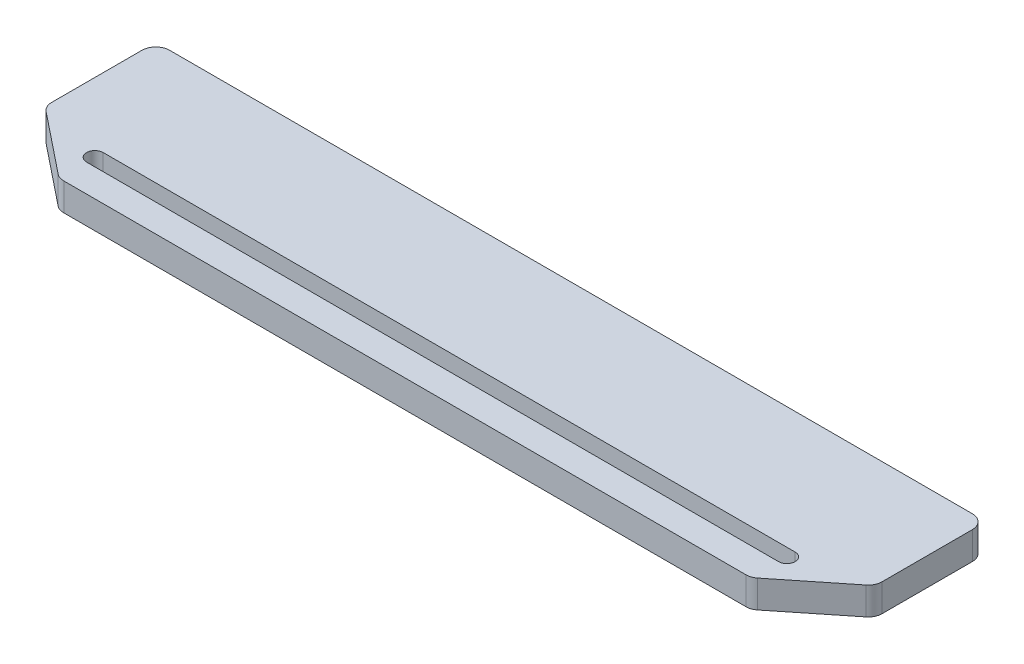
ISO-10303-21;
HEADER;
FILE_DESCRIPTION(('STEP AP214'),'2;1');
FILE_NAME('part.step','',(''),(''),'','','');
FILE_SCHEMA(('AUTOMOTIVE_DESIGN { 1 0 10303 214 1 1 1 1 }'));
ENDSEC;
DATA;
#1=APPLICATION_CONTEXT('core data for automotive mechanical design processes');
#2=APPLICATION_PROTOCOL_DEFINITION('international standard','automotive_design',2000,#1);
#3=PRODUCT_CONTEXT('',#1,'mechanical');
#4=PRODUCT('Part','Part','',(#3));
#5=PRODUCT_RELATED_PRODUCT_CATEGORY('part','',(#4));
#6=PRODUCT_DEFINITION_FORMATION('','',#4);
#7=PRODUCT_DEFINITION_CONTEXT('part definition',#1,'design');
#8=PRODUCT_DEFINITION('design','',#6,#7);
#9=PRODUCT_DEFINITION_SHAPE('','',#8);
#10=(LENGTH_UNIT() NAMED_UNIT(*) SI_UNIT(.MILLI.,.METRE.));
#11=(NAMED_UNIT(*) PLANE_ANGLE_UNIT() SI_UNIT($,.RADIAN.));
#12=(NAMED_UNIT(*) SI_UNIT($,.STERADIAN.) SOLID_ANGLE_UNIT());
#13=UNCERTAINTY_MEASURE_WITH_UNIT(LENGTH_MEASURE(1.E-05),#10,'distance_accuracy_value','');
#14=(GEOMETRIC_REPRESENTATION_CONTEXT(3) GLOBAL_UNCERTAINTY_ASSIGNED_CONTEXT((#13)) GLOBAL_UNIT_ASSIGNED_CONTEXT((#10,
#11,#12)) REPRESENTATION_CONTEXT('',''));
#15=CARTESIAN_POINT('',(0.,0.,0.));
#16=DIRECTION('',(0.,0.,1.));
#17=DIRECTION('',(1.,0.,0.));
#18=AXIS2_PLACEMENT_3D('',#15,#16,#17);
#19=CARTESIAN_POINT('',(295.,10.,5.));
#20=DIRECTION('',(0.,1.,0.));
#21=DIRECTION('',(0.,0.,1.));
#22=AXIS2_PLACEMENT_3D('',#19,#20,#21);
#23=PLANE('',#22);
#24=CARTESIAN_POINT('',(295.,10.,5.));
#25=DIRECTION('',(0.,1.,0.));
#26=DIRECTION('',(0.,0.,1.));
#27=AXIS2_PLACEMENT_3D('',#24,#25,#26);
#28=CIRCLE('',#27,5.);
#29=CARTESIAN_POINT('',(300.,10.,5.00000000000004));
#30=VERTEX_POINT('',#29);
#31=CARTESIAN_POINT('',(295.,10.,0.));
#32=VERTEX_POINT('',#31);
#33=EDGE_CURVE('E174',#30,#32,#28,.T.);
#34=ORIENTED_EDGE('',*,*,#33,.T.);
#35=DIRECTION('',(-1.,0.,0.));
#36=VECTOR('',#35,1.);
#37=CARTESIAN_POINT('',(5.00000000000004,10.,0.));
#38=LINE('',#37,#36);
#39=CARTESIAN_POINT('',(5.,10.,0.));
#40=VERTEX_POINT('',#39);
#41=EDGE_CURVE('E135',#32,#40,#38,.T.);
#42=ORIENTED_EDGE('',*,*,#41,.T.);
#43=CARTESIAN_POINT('',(5.,10.,5.));
#44=DIRECTION('',(0.,1.,0.));
#45=DIRECTION('',(0.,0.,-1.));
#46=AXIS2_PLACEMENT_3D('',#43,#44,#45);
#47=CIRCLE('',#46,5.);
#48=CARTESIAN_POINT('',(0.,10.,5.00000000000004));
#49=VERTEX_POINT('',#48);
#50=EDGE_CURVE('E185',#40,#49,#47,.T.);
#51=ORIENTED_EDGE('',*,*,#50,.T.);
#52=DIRECTION('',(0.,0.,1.));
#53=VECTOR('',#52,1.);
#54=CARTESIAN_POINT('',(0.,10.,5.00000000000004));
#55=LINE('',#54,#53);
#56=CARTESIAN_POINT('',(0.,10.,37.5968757625672));
#57=VERTEX_POINT('',#56);
#58=EDGE_CURVE('E193',#49,#57,#55,.T.);
#59=ORIENTED_EDGE('',*,*,#58,.T.);
#60=CARTESIAN_POINT('',(5.,10.,37.5968757625672));
#61=DIRECTION('',(0.,1.,0.));
#62=DIRECTION('',(0.,0.,-1.));
#63=AXIS2_PLACEMENT_3D('',#60,#61,#62);
#64=CIRCLE('',#63,5.);
#65=CARTESIAN_POINT('',(1.87652476222788,10.,41.5012198097823));
#66=VERTEX_POINT('',#65);
#67=EDGE_CURVE('E195',#57,#66,#64,.T.);
#68=ORIENTED_EDGE('',*,*,#67,.T.);
#69=DIRECTION('',(0.78086880944303,0.,0.624695047554425));
#70=VECTOR('',#69,1.);
#71=CARTESIAN_POINT('',(1.87652476222788,10.,41.5012198097823));
#72=LINE('',#71,#70);
#73=CARTESIAN_POINT('',(23.6304300590189,10.,58.9043440472152));
#74=VERTEX_POINT('',#73);
#75=EDGE_CURVE('E197',#66,#74,#72,.T.);
#76=ORIENTED_EDGE('',*,*,#75,.T.);
#77=CARTESIAN_POINT('',(26.7539052967911,10.,55.));
#78=DIRECTION('',(0.,1.,0.));
#79=DIRECTION('',(0.,0.,1.));
#80=AXIS2_PLACEMENT_3D('',#77,#78,#79);
#81=CIRCLE('',#80,5.);
#82=CARTESIAN_POINT('',(26.7539052967911,10.,60.));
#83=VERTEX_POINT('',#82);
#84=EDGE_CURVE('E199',#74,#83,#81,.T.);
#85=ORIENTED_EDGE('',*,*,#84,.T.);
#86=DIRECTION('',(1.,0.,0.));
#87=VECTOR('',#86,1.);
#88=CARTESIAN_POINT('',(26.7539052967911,10.,60.));
#89=LINE('',#88,#87);
#90=CARTESIAN_POINT('',(273.246094703209,10.,60.));
#91=VERTEX_POINT('',#90);
#92=EDGE_CURVE('E201',#83,#91,#89,.T.);
#93=ORIENTED_EDGE('',*,*,#92,.T.);
#94=CARTESIAN_POINT('',(273.246094703209,10.,55.));
#95=DIRECTION('',(0.,1.,0.));
#96=DIRECTION('',(0.,0.,-1.));
#97=AXIS2_PLACEMENT_3D('',#94,#95,#96);
#98=CIRCLE('',#97,5.);
#99=CARTESIAN_POINT('',(276.369569940981,10.,58.9043440472152));
#100=VERTEX_POINT('',#99);
#101=EDGE_CURVE('E203',#91,#100,#98,.T.);
#102=ORIENTED_EDGE('',*,*,#101,.T.);
#103=DIRECTION('',(0.78086880944303,0.,-0.624695047554424));
#104=VECTOR('',#103,1.);
#105=CARTESIAN_POINT('',(276.369569940981,10.,58.9043440472152));
#106=LINE('',#105,#104);
#107=CARTESIAN_POINT('',(298.123475237772,10.,41.5012198097823));
#108=VERTEX_POINT('',#107);
#109=EDGE_CURVE('E205',#100,#108,#106,.T.);
#110=ORIENTED_EDGE('',*,*,#109,.T.);
#111=CARTESIAN_POINT('',(295.,10.,37.5968757625672));
#112=DIRECTION('',(0.,1.,0.));
#113=DIRECTION('',(0.,0.,-1.));
#114=AXIS2_PLACEMENT_3D('',#111,#112,#113);
#115=CIRCLE('',#114,5.);
#116=CARTESIAN_POINT('',(300.,10.,37.5968757625672));
#117=VERTEX_POINT('',#116);
#118=EDGE_CURVE('E169',#108,#117,#115,.T.);
#119=ORIENTED_EDGE('',*,*,#118,.T.);
#120=DIRECTION('',(0.,0.,-1.));
#121=VECTOR('',#120,1.);
#122=CARTESIAN_POINT('',(300.,10.,5.00000000000004));
#123=LINE('',#122,#121);
#124=EDGE_CURVE('E171',#117,#30,#123,.T.);
#125=ORIENTED_EDGE('',*,*,#124,.T.);
#126=EDGE_LOOP('',(#34,#42,#51,#59,#68,#76,#85,#93,#102,#110,#119,#125));
#127=FACE_BOUND('',#126,.T.);
#128=DIRECTION('',(1.,0.,0.));
#129=VECTOR('',#128,1.);
#130=CARTESIAN_POINT('',(25.,10.,50.));
#131=LINE('',#130,#129);
#132=CARTESIAN_POINT('',(25.,10.,50.));
#133=VERTEX_POINT('',#132);
#134=CARTESIAN_POINT('',(275.,10.,50.));
#135=VERTEX_POINT('',#134);
#136=EDGE_CURVE('E271',#133,#135,#131,.T.);
#137=ORIENTED_EDGE('',*,*,#136,.F.);
#138=CARTESIAN_POINT('',(25.,10.,47.));
#139=DIRECTION('',(0.,1.,0.));
#140=DIRECTION('',(0.,0.,1.));
#141=AXIS2_PLACEMENT_3D('',#138,#139,#140);
#142=CIRCLE('',#141,3.);
#143=CARTESIAN_POINT('',(25.,10.,44.));
#144=VERTEX_POINT('',#143);
#145=EDGE_CURVE('E281',#144,#133,#142,.T.);
#146=ORIENTED_EDGE('',*,*,#145,.F.);
#147=DIRECTION('',(-1.,0.,0.));
#148=VECTOR('',#147,1.);
#149=CARTESIAN_POINT('',(25.,10.,44.));
#150=LINE('',#149,#148);
#151=CARTESIAN_POINT('',(275.,10.,44.));
#152=VERTEX_POINT('',#151);
#153=EDGE_CURVE('E284',#152,#144,#150,.T.);
#154=ORIENTED_EDGE('',*,*,#153,.F.);
#155=CARTESIAN_POINT('',(275.,10.,47.));
#156=DIRECTION('',(0.,1.,0.));
#157=DIRECTION('',(0.,0.,1.));
#158=AXIS2_PLACEMENT_3D('',#155,#156,#157);
#159=CIRCLE('',#158,3.);
#160=EDGE_CURVE('E287',#135,#152,#159,.T.);
#161=ORIENTED_EDGE('',*,*,#160,.F.);
#162=EDGE_LOOP('',(#137,#146,#154,#161));
#163=FACE_BOUND('',#162,.T.);
#164=ADVANCED_FACE('F41',(#127,#163),#23,.T.);
#165=CARTESIAN_POINT('',(295.,0.,5.));
#166=DIRECTION('',(0.,1.,0.));
#167=DIRECTION('',(0.,0.,1.));
#168=AXIS2_PLACEMENT_3D('',#165,#166,#167);
#169=PLANE('',#168);
#170=CARTESIAN_POINT('',(295.,0.,5.));
#171=DIRECTION('',(0.,1.,0.));
#172=DIRECTION('',(0.,0.,1.));
#173=AXIS2_PLACEMENT_3D('',#170,#171,#172);
#174=CIRCLE('',#173,5.);
#175=CARTESIAN_POINT('',(300.,0.,5.00000000000004));
#176=VERTEX_POINT('',#175);
#177=CARTESIAN_POINT('',(295.,0.,0.));
#178=VERTEX_POINT('',#177);
#179=EDGE_CURVE('E208',#176,#178,#174,.T.);
#180=ORIENTED_EDGE('',*,*,#179,.F.);
#181=DIRECTION('',(0.,0.,-1.));
#182=VECTOR('',#181,1.);
#183=CARTESIAN_POINT('',(300.,0.,5.00000000000004));
#184=LINE('',#183,#182);
#185=CARTESIAN_POINT('',(300.,0.,37.5968757625672));
#186=VERTEX_POINT('',#185);
#187=EDGE_CURVE('E127',#186,#176,#184,.T.);
#188=ORIENTED_EDGE('',*,*,#187,.F.);
#189=CARTESIAN_POINT('',(295.,0.,37.5968757625672));
#190=DIRECTION('',(0.,1.,0.));
#191=DIRECTION('',(0.,0.,-1.));
#192=AXIS2_PLACEMENT_3D('',#189,#190,#191);
#193=CIRCLE('',#192,5.);
#194=CARTESIAN_POINT('',(298.123475237772,0.,41.5012198097823));
#195=VERTEX_POINT('',#194);
#196=EDGE_CURVE('E120',#195,#186,#193,.T.);
#197=ORIENTED_EDGE('',*,*,#196,.F.);
#198=DIRECTION('',(0.78086880944303,0.,-0.624695047554424));
#199=VECTOR('',#198,1.);
#200=CARTESIAN_POINT('',(276.369569940981,0.,58.9043440472152));
#201=LINE('',#200,#199);
#202=CARTESIAN_POINT('',(276.369569940981,0.,58.9043440472152));
#203=VERTEX_POINT('',#202);
#204=EDGE_CURVE('E226',#203,#195,#201,.T.);
#205=ORIENTED_EDGE('',*,*,#204,.F.);
#206=CARTESIAN_POINT('',(273.246094703209,0.,55.));
#207=DIRECTION('',(0.,1.,0.));
#208=DIRECTION('',(0.,0.,-1.));
#209=AXIS2_PLACEMENT_3D('',#206,#207,#208);
#210=CIRCLE('',#209,5.);
#211=CARTESIAN_POINT('',(273.246094703209,0.,60.));
#212=VERTEX_POINT('',#211);
#213=EDGE_CURVE('E224',#212,#203,#210,.T.);
#214=ORIENTED_EDGE('',*,*,#213,.F.);
#215=DIRECTION('',(1.,0.,0.));
#216=VECTOR('',#215,1.);
#217=CARTESIAN_POINT('',(26.7539052967911,0.,60.));
#218=LINE('',#217,#216);
#219=CARTESIAN_POINT('',(26.7539052967911,0.,60.));
#220=VERTEX_POINT('',#219);
#221=EDGE_CURVE('E222',#220,#212,#218,.T.);
#222=ORIENTED_EDGE('',*,*,#221,.F.);
#223=CARTESIAN_POINT('',(26.7539052967911,0.,55.));
#224=DIRECTION('',(0.,1.,0.));
#225=DIRECTION('',(0.,0.,1.));
#226=AXIS2_PLACEMENT_3D('',#223,#224,#225);
#227=CIRCLE('',#226,5.);
#228=CARTESIAN_POINT('',(23.6304300590189,0.,58.9043440472152));
#229=VERTEX_POINT('',#228);
#230=EDGE_CURVE('E220',#229,#220,#227,.T.);
#231=ORIENTED_EDGE('',*,*,#230,.F.);
#232=DIRECTION('',(0.78086880944303,0.,0.624695047554425));
#233=VECTOR('',#232,1.);
#234=CARTESIAN_POINT('',(1.87652476222788,0.,41.5012198097823));
#235=LINE('',#234,#233);
#236=CARTESIAN_POINT('',(1.87652476222788,0.,41.5012198097823));
#237=VERTEX_POINT('',#236);
#238=EDGE_CURVE('E218',#237,#229,#235,.T.);
#239=ORIENTED_EDGE('',*,*,#238,.F.);
#240=CARTESIAN_POINT('',(5.,0.,37.5968757625672));
#241=DIRECTION('',(0.,1.,0.));
#242=DIRECTION('',(0.,0.,-1.));
#243=AXIS2_PLACEMENT_3D('',#240,#241,#242);
#244=CIRCLE('',#243,5.);
#245=CARTESIAN_POINT('',(0.,0.,37.5968757625672));
#246=VERTEX_POINT('',#245);
#247=EDGE_CURVE('E216',#246,#237,#244,.T.);
#248=ORIENTED_EDGE('',*,*,#247,.F.);
#249=DIRECTION('',(0.,0.,1.));
#250=VECTOR('',#249,1.);
#251=CARTESIAN_POINT('',(0.,0.,5.00000000000004));
#252=LINE('',#251,#250);
#253=CARTESIAN_POINT('',(0.,0.,5.00000000000004));
#254=VERTEX_POINT('',#253);
#255=EDGE_CURVE('E214',#254,#246,#252,.T.);
#256=ORIENTED_EDGE('',*,*,#255,.F.);
#257=CARTESIAN_POINT('',(5.,0.,5.));
#258=DIRECTION('',(0.,1.,0.));
#259=DIRECTION('',(0.,0.,-1.));
#260=AXIS2_PLACEMENT_3D('',#257,#258,#259);
#261=CIRCLE('',#260,5.);
#262=CARTESIAN_POINT('',(5.,0.,0.));
#263=VERTEX_POINT('',#262);
#264=EDGE_CURVE('E212',#263,#254,#261,.T.);
#265=ORIENTED_EDGE('',*,*,#264,.F.);
#266=DIRECTION('',(-1.,0.,0.));
#267=VECTOR('',#266,1.);
#268=CARTESIAN_POINT('',(5.00000000000004,0.,0.));
#269=LINE('',#268,#267);
#270=EDGE_CURVE('E85',#178,#263,#269,.T.);
#271=ORIENTED_EDGE('',*,*,#270,.F.);
#272=EDGE_LOOP('',(#180,#188,#197,#205,#214,#222,#231,#239,#248,#256,#265,#271));
#273=FACE_BOUND('',#272,.T.);
#274=CARTESIAN_POINT('',(25.,0.,47.));
#275=DIRECTION('',(0.,-1.,0.));
#276=DIRECTION('',(0.,0.,-1.));
#277=AXIS2_PLACEMENT_3D('',#274,#275,#276);
#278=CIRCLE('',#277,3.);
#279=CARTESIAN_POINT('',(25.,0.,50.));
#280=VERTEX_POINT('',#279);
#281=CARTESIAN_POINT('',(25.,0.,44.));
#282=VERTEX_POINT('',#281);
#283=EDGE_CURVE('E11',#280,#282,#278,.T.);
#284=ORIENTED_EDGE('',*,*,#283,.F.);
#285=DIRECTION('',(-1.,0.,0.));
#286=VECTOR('',#285,1.);
#287=CARTESIAN_POINT('',(25.,0.,50.));
#288=LINE('',#287,#286);
#289=CARTESIAN_POINT('',(275.,0.,50.));
#290=VERTEX_POINT('',#289);
#291=EDGE_CURVE('E50',#290,#280,#288,.T.);
#292=ORIENTED_EDGE('',*,*,#291,.F.);
#293=CARTESIAN_POINT('',(275.,0.,47.));
#294=DIRECTION('',(0.,-1.,0.));
#295=DIRECTION('',(0.,0.,-1.));
#296=AXIS2_PLACEMENT_3D('',#293,#294,#295);
#297=CIRCLE('',#296,3.);
#298=CARTESIAN_POINT('',(275.,0.,44.));
#299=VERTEX_POINT('',#298);
#300=EDGE_CURVE('E259',#299,#290,#297,.T.);
#301=ORIENTED_EDGE('',*,*,#300,.F.);
#302=DIRECTION('',(1.,0.,0.));
#303=VECTOR('',#302,1.);
#304=CARTESIAN_POINT('',(25.,0.,44.));
#305=LINE('',#304,#303);
#306=EDGE_CURVE('E257',#282,#299,#305,.T.);
#307=ORIENTED_EDGE('',*,*,#306,.F.);
#308=EDGE_LOOP('',(#284,#292,#301,#307));
#309=FACE_BOUND('',#308,.T.);
#310=ADVANCED_FACE('F273',(#273,#309),#169,.F.);
#311=CARTESIAN_POINT('',(295.,10.,5.));
#312=DIRECTION('',(0.,-1.,0.));
#313=DIRECTION('',(0.,0.,-1.));
#314=AXIS2_PLACEMENT_3D('',#311,#312,#313);
#315=CYLINDRICAL_SURFACE('',#314,5.);
#316=ORIENTED_EDGE('',*,*,#179,.T.);
#317=DIRECTION('',(0.,-1.,0.));
#318=VECTOR('',#317,1.);
#319=CARTESIAN_POINT('',(295.,10.,0.));
#320=LINE('',#319,#318);
#321=EDGE_CURVE('E183',#32,#178,#320,.T.);
#322=ORIENTED_EDGE('',*,*,#321,.F.);
#323=ORIENTED_EDGE('',*,*,#33,.F.);
#324=DIRECTION('',(0.,-1.,0.));
#325=VECTOR('',#324,1.);
#326=CARTESIAN_POINT('',(300.,10.,5.00000000000004));
#327=LINE('',#326,#325);
#328=EDGE_CURVE('E176',#30,#176,#327,.T.);
#329=ORIENTED_EDGE('',*,*,#328,.T.);
#330=EDGE_LOOP('',(#316,#322,#323,#329));
#331=FACE_BOUND('',#330,.T.);
#332=ADVANCED_FACE('F43',(#331),#315,.T.);
#333=CARTESIAN_POINT('',(5.00000000000004,10.,0.));
#334=DIRECTION('',(0.,0.,1.));
#335=DIRECTION('',(1.,0.,0.));
#336=AXIS2_PLACEMENT_3D('',#333,#334,#335);
#337=PLANE('',#336);
#338=ORIENTED_EDGE('',*,*,#270,.T.);
#339=DIRECTION('',(0.,-1.,0.));
#340=VECTOR('',#339,1.);
#341=CARTESIAN_POINT('',(5.,10.,0.));
#342=LINE('',#341,#340);
#343=EDGE_CURVE('E253',#40,#263,#342,.T.);
#344=ORIENTED_EDGE('',*,*,#343,.F.);
#345=ORIENTED_EDGE('',*,*,#41,.F.);
#346=ORIENTED_EDGE('',*,*,#321,.T.);
#347=EDGE_LOOP('',(#338,#344,#345,#346));
#348=FACE_BOUND('',#347,.T.);
#349=ADVANCED_FACE('F343',(#348),#337,.F.);
#350=CARTESIAN_POINT('',(5.,10.,5.));
#351=DIRECTION('',(0.,-1.,0.));
#352=DIRECTION('',(0.,0.,-1.));
#353=AXIS2_PLACEMENT_3D('',#350,#351,#352);
#354=CYLINDRICAL_SURFACE('',#353,5.);
#355=ORIENTED_EDGE('',*,*,#264,.T.);
#356=DIRECTION('',(0.,-1.,0.));
#357=VECTOR('',#356,1.);
#358=CARTESIAN_POINT('',(0.,10.,5.00000000000004));
#359=LINE('',#358,#357);
#360=EDGE_CURVE('E250',#49,#254,#359,.T.);
#361=ORIENTED_EDGE('',*,*,#360,.F.);
#362=ORIENTED_EDGE('',*,*,#50,.F.);
#363=ORIENTED_EDGE('',*,*,#343,.T.);
#364=EDGE_LOOP('',(#355,#361,#362,#363));
#365=FACE_BOUND('',#364,.T.);
#366=ADVANCED_FACE('F340',(#365),#354,.T.);
#367=CARTESIAN_POINT('',(0.,10.,5.00000000000004));
#368=DIRECTION('',(1.,0.,0.));
#369=DIRECTION('',(0.,0.,-1.));
#370=AXIS2_PLACEMENT_3D('',#367,#368,#369);
#371=PLANE('',#370);
#372=ORIENTED_EDGE('',*,*,#255,.T.);
#373=DIRECTION('',(0.,-1.,0.));
#374=VECTOR('',#373,1.);
#375=CARTESIAN_POINT('',(0.,10.,37.5968757625672));
#376=LINE('',#375,#374);
#377=EDGE_CURVE('E247',#57,#246,#376,.T.);
#378=ORIENTED_EDGE('',*,*,#377,.F.);
#379=ORIENTED_EDGE('',*,*,#58,.F.);
#380=ORIENTED_EDGE('',*,*,#360,.T.);
#381=EDGE_LOOP('',(#372,#378,#379,#380));
#382=FACE_BOUND('',#381,.T.);
#383=ADVANCED_FACE('F336',(#382),#371,.F.);
#384=CARTESIAN_POINT('',(5.,10.,37.5968757625672));
#385=DIRECTION('',(0.,-1.,0.));
#386=DIRECTION('',(0.,0.,-1.));
#387=AXIS2_PLACEMENT_3D('',#384,#385,#386);
#388=CYLINDRICAL_SURFACE('',#387,5.);
#389=ORIENTED_EDGE('',*,*,#247,.T.);
#390=DIRECTION('',(0.,-1.,0.));
#391=VECTOR('',#390,1.);
#392=CARTESIAN_POINT('',(1.87652476222788,10.,41.5012198097823));
#393=LINE('',#392,#391);
#394=EDGE_CURVE('E244',#66,#237,#393,.T.);
#395=ORIENTED_EDGE('',*,*,#394,.F.);
#396=ORIENTED_EDGE('',*,*,#67,.F.);
#397=ORIENTED_EDGE('',*,*,#377,.T.);
#398=EDGE_LOOP('',(#389,#395,#396,#397));
#399=FACE_BOUND('',#398,.T.);
#400=ADVANCED_FACE('F332',(#399),#388,.T.);
#401=CARTESIAN_POINT('',(1.87652476222788,10.,41.5012198097823));
#402=DIRECTION('',(0.624695047554425,0.,-0.78086880944303));
#403=DIRECTION('',(-0.78086880944303,0.,-0.624695047554425));
#404=AXIS2_PLACEMENT_3D('',#401,#402,#403);
#405=PLANE('',#404);
#406=ORIENTED_EDGE('',*,*,#238,.T.);
#407=DIRECTION('',(0.,-1.,0.));
#408=VECTOR('',#407,1.);
#409=CARTESIAN_POINT('',(23.6304300590189,10.,58.9043440472152));
#410=LINE('',#409,#408);
#411=EDGE_CURVE('E241',#74,#229,#410,.T.);
#412=ORIENTED_EDGE('',*,*,#411,.F.);
#413=ORIENTED_EDGE('',*,*,#75,.F.);
#414=ORIENTED_EDGE('',*,*,#394,.T.);
#415=EDGE_LOOP('',(#406,#412,#413,#414));
#416=FACE_BOUND('',#415,.T.);
#417=ADVANCED_FACE('F328',(#416),#405,.F.);
#418=CARTESIAN_POINT('',(26.7539052967911,10.,55.));
#419=DIRECTION('',(0.,-1.,0.));
#420=DIRECTION('',(0.,0.,-1.));
#421=AXIS2_PLACEMENT_3D('',#418,#419,#420);
#422=CYLINDRICAL_SURFACE('',#421,5.);
#423=ORIENTED_EDGE('',*,*,#230,.T.);
#424=DIRECTION('',(0.,-1.,0.));
#425=VECTOR('',#424,1.);
#426=CARTESIAN_POINT('',(26.7539052967911,10.,60.));
#427=LINE('',#426,#425);
#428=EDGE_CURVE('E238',#83,#220,#427,.T.);
#429=ORIENTED_EDGE('',*,*,#428,.F.);
#430=ORIENTED_EDGE('',*,*,#84,.F.);
#431=ORIENTED_EDGE('',*,*,#411,.T.);
#432=EDGE_LOOP('',(#423,#429,#430,#431));
#433=FACE_BOUND('',#432,.T.);
#434=ADVANCED_FACE('F324',(#433),#422,.T.);
#435=CARTESIAN_POINT('',(26.7539052967911,10.,60.));
#436=DIRECTION('',(0.,0.,-1.));
#437=DIRECTION('',(-1.,0.,0.));
#438=AXIS2_PLACEMENT_3D('',#435,#436,#437);
#439=PLANE('',#438);
#440=ORIENTED_EDGE('',*,*,#221,.T.);
#441=DIRECTION('',(0.,-1.,0.));
#442=VECTOR('',#441,1.);
#443=CARTESIAN_POINT('',(273.246094703209,10.,60.));
#444=LINE('',#443,#442);
#445=EDGE_CURVE('E235',#91,#212,#444,.T.);
#446=ORIENTED_EDGE('',*,*,#445,.F.);
#447=ORIENTED_EDGE('',*,*,#92,.F.);
#448=ORIENTED_EDGE('',*,*,#428,.T.);
#449=EDGE_LOOP('',(#440,#446,#447,#448));
#450=FACE_BOUND('',#449,.T.);
#451=ADVANCED_FACE('F320',(#450),#439,.F.);
#452=CARTESIAN_POINT('',(273.246094703209,10.,55.));
#453=DIRECTION('',(0.,-1.,0.));
#454=DIRECTION('',(0.,0.,-1.));
#455=AXIS2_PLACEMENT_3D('',#452,#453,#454);
#456=CYLINDRICAL_SURFACE('',#455,5.);
#457=ORIENTED_EDGE('',*,*,#213,.T.);
#458=DIRECTION('',(0.,-1.,0.));
#459=VECTOR('',#458,1.);
#460=CARTESIAN_POINT('',(276.369569940981,10.,58.9043440472152));
#461=LINE('',#460,#459);
#462=EDGE_CURVE('E232',#100,#203,#461,.T.);
#463=ORIENTED_EDGE('',*,*,#462,.F.);
#464=ORIENTED_EDGE('',*,*,#101,.F.);
#465=ORIENTED_EDGE('',*,*,#445,.T.);
#466=EDGE_LOOP('',(#457,#463,#464,#465));
#467=FACE_BOUND('',#466,.T.);
#468=ADVANCED_FACE('F316',(#467),#456,.T.);
#469=CARTESIAN_POINT('',(276.369569940981,10.,58.9043440472152));
#470=DIRECTION('',(-0.624695047554424,0.,-0.78086880944303));
#471=DIRECTION('',(-0.78086880944303,0.,0.624695047554424));
#472=AXIS2_PLACEMENT_3D('',#469,#470,#471);
#473=PLANE('',#472);
#474=ORIENTED_EDGE('',*,*,#204,.T.);
#475=DIRECTION('',(0.,-1.,0.));
#476=VECTOR('',#475,1.);
#477=CARTESIAN_POINT('',(298.123475237772,10.,41.5012198097823));
#478=LINE('',#477,#476);
#479=EDGE_CURVE('E230',#108,#195,#478,.T.);
#480=ORIENTED_EDGE('',*,*,#479,.F.);
#481=ORIENTED_EDGE('',*,*,#109,.F.);
#482=ORIENTED_EDGE('',*,*,#462,.T.);
#483=EDGE_LOOP('',(#474,#480,#481,#482));
#484=FACE_BOUND('',#483,.T.);
#485=ADVANCED_FACE('F313',(#484),#473,.F.);
#486=CARTESIAN_POINT('',(295.,10.,37.5968757625672));
#487=DIRECTION('',(0.,-1.,0.));
#488=DIRECTION('',(0.,0.,-1.));
#489=AXIS2_PLACEMENT_3D('',#486,#487,#488);
#490=CYLINDRICAL_SURFACE('',#489,5.);
#491=ORIENTED_EDGE('',*,*,#196,.T.);
#492=DIRECTION('',(0.,-1.,0.));
#493=VECTOR('',#492,1.);
#494=CARTESIAN_POINT('',(300.,10.,37.5968757625672));
#495=LINE('',#494,#493);
#496=EDGE_CURVE('E181',#117,#186,#495,.T.);
#497=ORIENTED_EDGE('',*,*,#496,.F.);
#498=ORIENTED_EDGE('',*,*,#118,.F.);
#499=ORIENTED_EDGE('',*,*,#479,.T.);
#500=EDGE_LOOP('',(#491,#497,#498,#499));
#501=FACE_BOUND('',#500,.T.);
#502=ADVANCED_FACE('F310',(#501),#490,.T.);
#503=CARTESIAN_POINT('',(300.,10.,5.00000000000004));
#504=DIRECTION('',(-1.,0.,0.));
#505=DIRECTION('',(0.,0.,1.));
#506=AXIS2_PLACEMENT_3D('',#503,#504,#505);
#507=PLANE('',#506);
#508=ORIENTED_EDGE('',*,*,#187,.T.);
#509=ORIENTED_EDGE('',*,*,#328,.F.);
#510=ORIENTED_EDGE('',*,*,#124,.F.);
#511=ORIENTED_EDGE('',*,*,#496,.T.);
#512=EDGE_LOOP('',(#508,#509,#510,#511));
#513=FACE_BOUND('',#512,.T.);
#514=ADVANCED_FACE('F178',(#513),#507,.F.);
#515=CARTESIAN_POINT('',(25.,10.,47.));
#516=DIRECTION('',(0.,-1.,0.));
#517=DIRECTION('',(0.,0.,-1.));
#518=AXIS2_PLACEMENT_3D('',#515,#516,#517);
#519=CYLINDRICAL_SURFACE('',#518,3.);
#520=ORIENTED_EDGE('',*,*,#283,.T.);
#521=DIRECTION('',(0.,-1.,0.));
#522=VECTOR('',#521,1.);
#523=CARTESIAN_POINT('',(25.,10.,44.));
#524=LINE('',#523,#522);
#525=EDGE_CURVE('E278',#144,#282,#524,.T.);
#526=ORIENTED_EDGE('',*,*,#525,.F.);
#527=ORIENTED_EDGE('',*,*,#145,.T.);
#528=DIRECTION('',(0.,-1.,0.));
#529=VECTOR('',#528,1.);
#530=CARTESIAN_POINT('',(25.,10.,50.));
#531=LINE('',#530,#529);
#532=EDGE_CURVE('E210',#133,#280,#531,.T.);
#533=ORIENTED_EDGE('',*,*,#532,.T.);
#534=EDGE_LOOP('',(#520,#526,#527,#533));
#535=FACE_BOUND('',#534,.T.);
#536=ADVANCED_FACE('F276',(#535),#519,.F.);
#537=CARTESIAN_POINT('',(25.,10.,50.));
#538=DIRECTION('',(0.,0.,-1.));
#539=DIRECTION('',(-1.,0.,0.));
#540=AXIS2_PLACEMENT_3D('',#537,#538,#539);
#541=PLANE('',#540);
#542=ORIENTED_EDGE('',*,*,#291,.T.);
#543=ORIENTED_EDGE('',*,*,#532,.F.);
#544=ORIENTED_EDGE('',*,*,#136,.T.);
#545=DIRECTION('',(0.,-1.,0.));
#546=VECTOR('',#545,1.);
#547=CARTESIAN_POINT('',(275.,10.,50.));
#548=LINE('',#547,#546);
#549=EDGE_CURVE('E189',#135,#290,#548,.T.);
#550=ORIENTED_EDGE('',*,*,#549,.T.);
#551=EDGE_LOOP('',(#542,#543,#544,#550));
#552=FACE_BOUND('',#551,.T.);
#553=ADVANCED_FACE('F269',(#552),#541,.T.);
#554=CARTESIAN_POINT('',(275.,10.,47.));
#555=DIRECTION('',(0.,-1.,0.));
#556=DIRECTION('',(0.,0.,-1.));
#557=AXIS2_PLACEMENT_3D('',#554,#555,#556);
#558=CYLINDRICAL_SURFACE('',#557,3.);
#559=ORIENTED_EDGE('',*,*,#300,.T.);
#560=ORIENTED_EDGE('',*,*,#549,.F.);
#561=ORIENTED_EDGE('',*,*,#160,.T.);
#562=DIRECTION('',(0.,-1.,0.));
#563=VECTOR('',#562,1.);
#564=CARTESIAN_POINT('',(275.,10.,44.));
#565=LINE('',#564,#563);
#566=EDGE_CURVE('E57',#152,#299,#565,.T.);
#567=ORIENTED_EDGE('',*,*,#566,.T.);
#568=EDGE_LOOP('',(#559,#560,#561,#567));
#569=FACE_BOUND('',#568,.T.);
#570=ADVANCED_FACE('F263',(#569),#558,.F.);
#571=CARTESIAN_POINT('',(25.,10.,44.));
#572=DIRECTION('',(0.,0.,1.));
#573=DIRECTION('',(1.,0.,0.));
#574=AXIS2_PLACEMENT_3D('',#571,#572,#573);
#575=PLANE('',#574);
#576=ORIENTED_EDGE('',*,*,#306,.T.);
#577=ORIENTED_EDGE('',*,*,#566,.F.);
#578=ORIENTED_EDGE('',*,*,#153,.T.);
#579=ORIENTED_EDGE('',*,*,#525,.T.);
#580=EDGE_LOOP('',(#576,#577,#578,#579));
#581=FACE_BOUND('',#580,.T.);
#582=ADVANCED_FACE('F291',(#581),#575,.T.);
#583=CLOSED_SHELL('',(#164,#310,#332,#349,#366,#383,#400,#417,#434,#451,#468,#485,#502,#514,
#536,#553,#570,#582));
#584=MANIFOLD_SOLID_BREP('B2',#583);
#585=ADVANCED_BREP_SHAPE_REPRESENTATION('',(#18,#584),#14);
#586=SHAPE_DEFINITION_REPRESENTATION(#9,#585);
ENDSEC;
END-ISO-10303-21;
